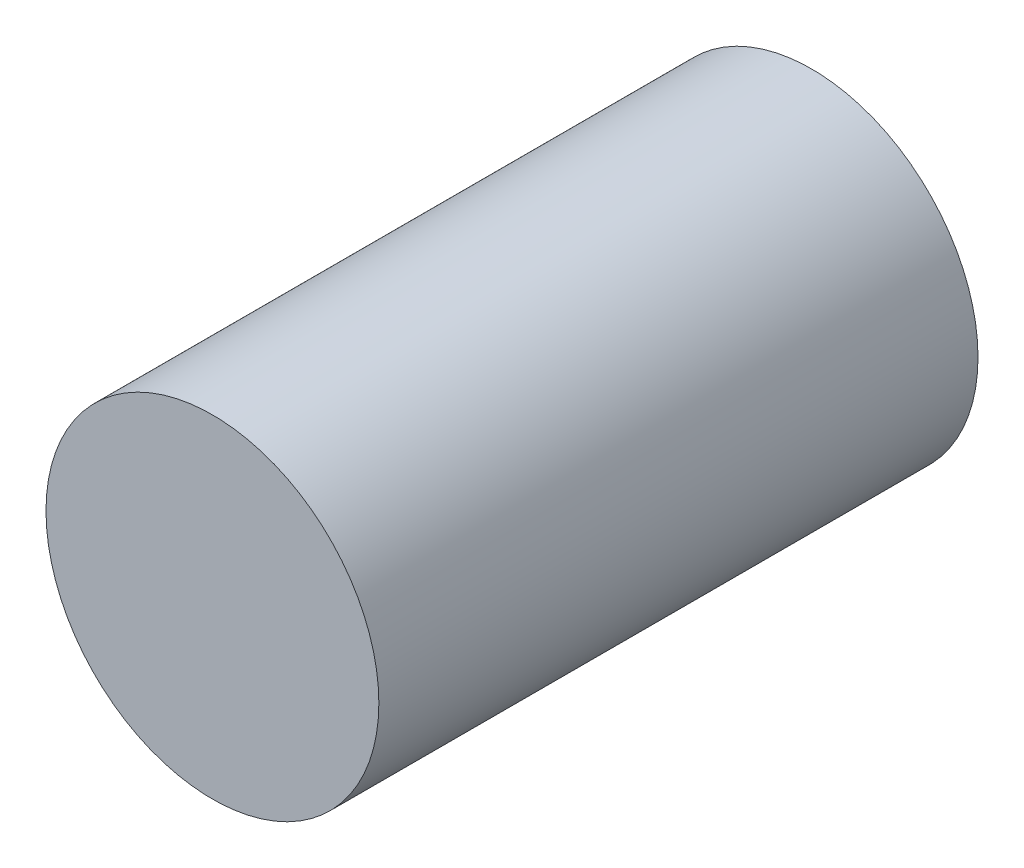
ISO-10303-21;
HEADER;
FILE_DESCRIPTION(('STEP AP214'),'2;1');
FILE_NAME('part.step','',(''),(''),'','','');
FILE_SCHEMA(('AUTOMOTIVE_DESIGN { 1 0 10303 214 1 1 1 1 }'));
ENDSEC;
DATA;
#1=APPLICATION_CONTEXT('core data for automotive mechanical design processes');
#2=APPLICATION_PROTOCOL_DEFINITION('international standard','automotive_design',2000,#1);
#3=PRODUCT_CONTEXT('',#1,'mechanical');
#4=PRODUCT('Part','Part','',(#3));
#5=PRODUCT_RELATED_PRODUCT_CATEGORY('part','',(#4));
#6=PRODUCT_DEFINITION_FORMATION('','',#4);
#7=PRODUCT_DEFINITION_CONTEXT('part definition',#1,'design');
#8=PRODUCT_DEFINITION('design','',#6,#7);
#9=PRODUCT_DEFINITION_SHAPE('','',#8);
#10=(LENGTH_UNIT() NAMED_UNIT(*) SI_UNIT(.MILLI.,.METRE.));
#11=(NAMED_UNIT(*) PLANE_ANGLE_UNIT() SI_UNIT($,.RADIAN.));
#12=(NAMED_UNIT(*) SI_UNIT($,.STERADIAN.) SOLID_ANGLE_UNIT());
#13=UNCERTAINTY_MEASURE_WITH_UNIT(LENGTH_MEASURE(1.E-05),#10,'distance_accuracy_value','');
#14=(GEOMETRIC_REPRESENTATION_CONTEXT(3) GLOBAL_UNCERTAINTY_ASSIGNED_CONTEXT((#13)) GLOBAL_UNIT_ASSIGNED_CONTEXT((#10,
#11,#12)) REPRESENTATION_CONTEXT('',''));
#15=CARTESIAN_POINT('',(0.,0.,0.));
#16=DIRECTION('',(0.,0.,1.));
#17=DIRECTION('',(1.,0.,0.));
#18=AXIS2_PLACEMENT_3D('',#15,#16,#17);
#19=CARTESIAN_POINT('',(0.,0.,9.));
#20=DIRECTION('',(0.,0.,-1.));
#21=DIRECTION('',(-1.,0.,0.));
#22=AXIS2_PLACEMENT_3D('',#19,#20,#21);
#23=CYLINDRICAL_SURFACE('',#22,5.00000000000002);
#24=CARTESIAN_POINT('',(0.,0.,9.));
#25=DIRECTION('',(0.,0.,1.));
#26=DIRECTION('',(1.,0.,0.));
#27=AXIS2_PLACEMENT_3D('',#24,#25,#26);
#28=CIRCLE('',#27,5.00000000000002);
#29=CARTESIAN_POINT('',(5.00000000000002,0.,9.));
#30=VERTEX_POINT('',#29);
#31=EDGE_CURVE('E10',#30,#30,#28,.T.);
#32=ORIENTED_EDGE('',*,*,#31,.F.);
#33=EDGE_LOOP('',(#32));
#34=FACE_BOUND('',#33,.T.);
#35=CARTESIAN_POINT('',(0.,0.,-9.));
#36=DIRECTION('',(0.,0.,1.));
#37=DIRECTION('',(1.,0.,0.));
#38=AXIS2_PLACEMENT_3D('',#35,#36,#37);
#39=CIRCLE('',#38,5.00000000000002);
#40=CARTESIAN_POINT('',(5.00000000000002,0.,-9.));
#41=VERTEX_POINT('',#40);
#42=EDGE_CURVE('E34',#41,#41,#39,.T.);
#43=ORIENTED_EDGE('',*,*,#42,.T.);
#44=EDGE_LOOP('',(#43));
#45=FACE_BOUND('',#44,.T.);
#46=ADVANCED_FACE('F31',(#34,#45),#23,.T.);
#47=CARTESIAN_POINT('',(0.,0.,9.));
#48=DIRECTION('',(0.,0.,1.));
#49=DIRECTION('',(1.,0.,0.));
#50=AXIS2_PLACEMENT_3D('',#47,#48,#49);
#51=PLANE('',#50);
#52=ORIENTED_EDGE('',*,*,#31,.T.);
#53=EDGE_LOOP('',(#52));
#54=FACE_BOUND('',#53,.T.);
#55=ADVANCED_FACE('F46',(#54),#51,.T.);
#56=CARTESIAN_POINT('',(0.,0.,-9.));
#57=DIRECTION('',(0.,0.,1.));
#58=DIRECTION('',(1.,0.,0.));
#59=AXIS2_PLACEMENT_3D('',#56,#57,#58);
#60=PLANE('',#59);
#61=ORIENTED_EDGE('',*,*,#42,.F.);
#62=EDGE_LOOP('',(#61));
#63=FACE_BOUND('',#62,.T.);
#64=ADVANCED_FACE('F44',(#63),#60,.F.);
#65=CLOSED_SHELL('',(#46,#55,#64));
#66=MANIFOLD_SOLID_BREP('B2',#65);
#67=ADVANCED_BREP_SHAPE_REPRESENTATION('',(#18,#66),#14);
#68=SHAPE_DEFINITION_REPRESENTATION(#9,#67);
ENDSEC;
END-ISO-10303-21;
